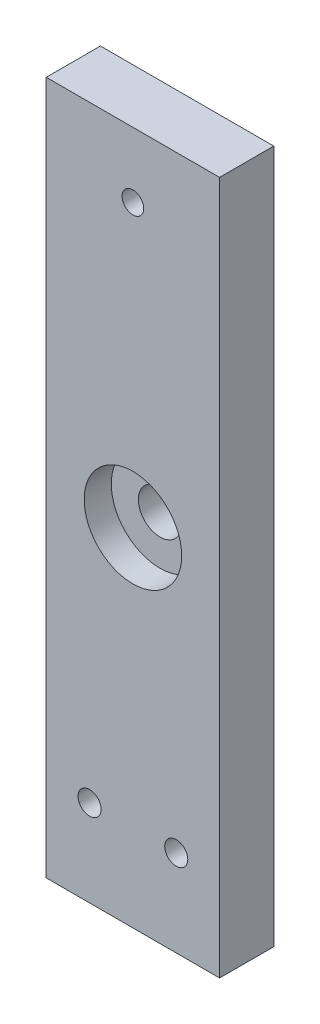
ISO-10303-21;
HEADER;
FILE_DESCRIPTION(('STEP AP214'),'2;1');
FILE_NAME('part.step','',(''),(''),'','','');
FILE_SCHEMA(('AUTOMOTIVE_DESIGN { 1 0 10303 214 1 1 1 1 }'));
ENDSEC;
DATA;
#1=APPLICATION_CONTEXT('core data for automotive mechanical design processes');
#2=APPLICATION_PROTOCOL_DEFINITION('international standard','automotive_design',2000,#1);
#3=PRODUCT_CONTEXT('',#1,'mechanical');
#4=PRODUCT('Part','Part','',(#3));
#5=PRODUCT_RELATED_PRODUCT_CATEGORY('part','',(#4));
#6=PRODUCT_DEFINITION_FORMATION('','',#4);
#7=PRODUCT_DEFINITION_CONTEXT('part definition',#1,'design');
#8=PRODUCT_DEFINITION('design','',#6,#7);
#9=PRODUCT_DEFINITION_SHAPE('','',#8);
#10=(LENGTH_UNIT() NAMED_UNIT(*) SI_UNIT(.MILLI.,.METRE.));
#11=(NAMED_UNIT(*) PLANE_ANGLE_UNIT() SI_UNIT($,.RADIAN.));
#12=(NAMED_UNIT(*) SI_UNIT($,.STERADIAN.) SOLID_ANGLE_UNIT());
#13=UNCERTAINTY_MEASURE_WITH_UNIT(LENGTH_MEASURE(1.E-05),#10,'distance_accuracy_value','');
#14=(GEOMETRIC_REPRESENTATION_CONTEXT(3) GLOBAL_UNCERTAINTY_ASSIGNED_CONTEXT((#13)) GLOBAL_UNIT_ASSIGNED_CONTEXT((#10,
#11,#12)) REPRESENTATION_CONTEXT('',''));
#15=CARTESIAN_POINT('',(0.,0.,0.));
#16=DIRECTION('',(0.,0.,1.));
#17=DIRECTION('',(1.,0.,0.));
#18=AXIS2_PLACEMENT_3D('',#15,#16,#17);
#19=CARTESIAN_POINT('',(0.,76.2,15.875));
#20=DIRECTION('',(0.,0.,-1.));
#21=DIRECTION('',(-1.,0.,0.));
#22=AXIS2_PLACEMENT_3D('',#19,#20,#21);
#23=CYLINDRICAL_SURFACE('',#22,6.35);
#24=CARTESIAN_POINT('',(0.,76.2,0.));
#25=DIRECTION('',(0.,0.,-1.));
#26=DIRECTION('',(-1.,0.,0.));
#27=AXIS2_PLACEMENT_3D('',#24,#25,#26);
#28=CIRCLE('',#27,6.35);
#29=CARTESIAN_POINT('',(-6.35,76.2,0.));
#30=VERTEX_POINT('',#29);
#31=EDGE_CURVE('E247',#30,#30,#28,.T.);
#32=ORIENTED_EDGE('',*,*,#31,.T.);
#33=EDGE_LOOP('',(#32));
#34=FACE_BOUND('',#33,.T.);
#35=CARTESIAN_POINT('',(0.,76.2,7.9375));
#36=DIRECTION('',(0.,0.,1.));
#37=DIRECTION('',(1.,0.,0.));
#38=AXIS2_PLACEMENT_3D('',#35,#36,#37);
#39=CIRCLE('',#38,6.35);
#40=CARTESIAN_POINT('',(6.35,76.2,7.9375));
#41=VERTEX_POINT('',#40);
#42=EDGE_CURVE('E243',#41,#41,#39,.T.);
#43=ORIENTED_EDGE('',*,*,#42,.T.);
#44=EDGE_LOOP('',(#43));
#45=FACE_BOUND('',#44,.T.);
#46=ADVANCED_FACE('F33',(#34,#45),#23,.F.);
#47=CARTESIAN_POINT('',(-25.4,-25.4,15.875));
#48=DIRECTION('',(-1.,0.,0.));
#49=DIRECTION('',(0.,0.,1.));
#50=AXIS2_PLACEMENT_3D('',#47,#48,#49);
#51=PLANE('',#50);
#52=DIRECTION('',(0.,1.,0.));
#53=VECTOR('',#52,1.);
#54=CARTESIAN_POINT('',(-25.4,-25.4,0.));
#55=LINE('',#54,#53);
#56=CARTESIAN_POINT('',(-25.4,-25.4,0.));
#57=VERTEX_POINT('',#56);
#58=CARTESIAN_POINT('',(-25.4,177.8,0.));
#59=VERTEX_POINT('',#58);
#60=EDGE_CURVE('E100',#57,#59,#55,.T.);
#61=ORIENTED_EDGE('',*,*,#60,.F.);
#62=DIRECTION('',(0.,0.,-1.));
#63=VECTOR('',#62,1.);
#64=CARTESIAN_POINT('',(-25.4,-25.4,15.875));
#65=LINE('',#64,#63);
#66=CARTESIAN_POINT('',(-25.4,-25.4,15.875));
#67=VERTEX_POINT('',#66);
#68=EDGE_CURVE('E11',#67,#57,#65,.T.);
#69=ORIENTED_EDGE('',*,*,#68,.F.);
#70=DIRECTION('',(0.,1.,0.));
#71=VECTOR('',#70,1.);
#72=CARTESIAN_POINT('',(-25.4,-25.4,15.875));
#73=LINE('',#72,#71);
#74=CARTESIAN_POINT('',(-25.4,177.8,15.875));
#75=VERTEX_POINT('',#74);
#76=EDGE_CURVE('E94',#67,#75,#73,.T.);
#77=ORIENTED_EDGE('',*,*,#76,.T.);
#78=DIRECTION('',(0.,0.,-1.));
#79=VECTOR('',#78,1.);
#80=CARTESIAN_POINT('',(-25.4,177.8,15.875));
#81=LINE('',#80,#79);
#82=EDGE_CURVE('E37',#75,#59,#81,.T.);
#83=ORIENTED_EDGE('',*,*,#82,.T.);
#84=EDGE_LOOP('',(#61,#69,#77,#83));
#85=FACE_BOUND('',#84,.T.);
#86=ADVANCED_FACE('F35',(#85),#51,.T.);
#87=CARTESIAN_POINT('',(-25.4,-25.4,15.875));
#88=DIRECTION('',(0.,1.,0.));
#89=DIRECTION('',(0.,0.,1.));
#90=AXIS2_PLACEMENT_3D('',#87,#88,#89);
#91=PLANE('',#90);
#92=DIRECTION('',(1.,0.,0.));
#93=VECTOR('',#92,1.);
#94=CARTESIAN_POINT('',(-25.4,-25.4,0.));
#95=LINE('',#94,#93);
#96=CARTESIAN_POINT('',(25.4,-25.4,0.));
#97=VERTEX_POINT('',#96);
#98=EDGE_CURVE('E67',#57,#97,#95,.T.);
#99=ORIENTED_EDGE('',*,*,#98,.T.);
#100=DIRECTION('',(0.,0.,-1.));
#101=VECTOR('',#100,1.);
#102=CARTESIAN_POINT('',(25.4,-25.4,15.875));
#103=LINE('',#102,#101);
#104=CARTESIAN_POINT('',(25.4,-25.4,15.875));
#105=VERTEX_POINT('',#104);
#106=EDGE_CURVE('E43',#105,#97,#103,.T.);
#107=ORIENTED_EDGE('',*,*,#106,.F.);
#108=DIRECTION('',(1.,0.,0.));
#109=VECTOR('',#108,1.);
#110=CARTESIAN_POINT('',(-25.4,-25.4,15.875));
#111=LINE('',#110,#109);
#112=EDGE_CURVE('E84',#67,#105,#111,.T.);
#113=ORIENTED_EDGE('',*,*,#112,.F.);
#114=ORIENTED_EDGE('',*,*,#68,.T.);
#115=EDGE_LOOP('',(#99,#107,#113,#114));
#116=FACE_BOUND('',#115,.T.);
#117=ADVANCED_FACE('F111',(#116),#91,.F.);
#118=CARTESIAN_POINT('',(25.4,-25.4,15.875));
#119=DIRECTION('',(-1.,0.,0.));
#120=DIRECTION('',(0.,0.,1.));
#121=AXIS2_PLACEMENT_3D('',#118,#119,#120);
#122=PLANE('',#121);
#123=DIRECTION('',(0.,1.,0.));
#124=VECTOR('',#123,1.);
#125=CARTESIAN_POINT('',(25.4,-25.4,0.));
#126=LINE('',#125,#124);
#127=CARTESIAN_POINT('',(25.4,177.8,0.));
#128=VERTEX_POINT('',#127);
#129=EDGE_CURVE('E91',#97,#128,#126,.T.);
#130=ORIENTED_EDGE('',*,*,#129,.T.);
#131=DIRECTION('',(0.,0.,-1.));
#132=VECTOR('',#131,1.);
#133=CARTESIAN_POINT('',(25.4,177.8,15.875));
#134=LINE('',#133,#132);
#135=CARTESIAN_POINT('',(25.4,177.8,15.875));
#136=VERTEX_POINT('',#135);
#137=EDGE_CURVE('E88',#136,#128,#134,.T.);
#138=ORIENTED_EDGE('',*,*,#137,.F.);
#139=DIRECTION('',(0.,1.,0.));
#140=VECTOR('',#139,1.);
#141=CARTESIAN_POINT('',(25.4,-25.4,15.875));
#142=LINE('',#141,#140);
#143=EDGE_CURVE('E79',#105,#136,#142,.T.);
#144=ORIENTED_EDGE('',*,*,#143,.F.);
#145=ORIENTED_EDGE('',*,*,#106,.T.);
#146=EDGE_LOOP('',(#130,#138,#144,#145));
#147=FACE_BOUND('',#146,.T.);
#148=ADVANCED_FACE('F89',(#147),#122,.F.);
#149=CARTESIAN_POINT('',(-25.4,177.8,15.875));
#150=DIRECTION('',(0.,1.,0.));
#151=DIRECTION('',(0.,0.,1.));
#152=AXIS2_PLACEMENT_3D('',#149,#150,#151);
#153=PLANE('',#152);
#154=DIRECTION('',(1.,0.,0.));
#155=VECTOR('',#154,1.);
#156=CARTESIAN_POINT('',(-25.4,177.8,0.));
#157=LINE('',#156,#155);
#158=EDGE_CURVE('E103',#59,#128,#157,.T.);
#159=ORIENTED_EDGE('',*,*,#158,.F.);
#160=ORIENTED_EDGE('',*,*,#82,.F.);
#161=DIRECTION('',(1.,0.,0.));
#162=VECTOR('',#161,1.);
#163=CARTESIAN_POINT('',(-25.4,177.8,15.875));
#164=LINE('',#163,#162);
#165=EDGE_CURVE('E83',#75,#136,#164,.T.);
#166=ORIENTED_EDGE('',*,*,#165,.T.);
#167=ORIENTED_EDGE('',*,*,#137,.T.);
#168=EDGE_LOOP('',(#159,#160,#166,#167));
#169=FACE_BOUND('',#168,.T.);
#170=ADVANCED_FACE('F93',(#169),#153,.T.);
#171=CARTESIAN_POINT('',(0.,0.,15.875));
#172=DIRECTION('',(0.,0.,-1.));
#173=DIRECTION('',(-1.,0.,0.));
#174=AXIS2_PLACEMENT_3D('',#171,#172,#173);
#175=PLANE('',#174);
#176=CARTESIAN_POINT('',(0.,76.2,15.875));
#177=DIRECTION('',(0.,0.,1.));
#178=DIRECTION('',(1.,0.,0.));
#179=AXIS2_PLACEMENT_3D('',#176,#177,#178);
#180=CIRCLE('',#179,14.2875);
#181=CARTESIAN_POINT('',(14.2875,76.2,15.875));
#182=VERTEX_POINT('',#181);
#183=EDGE_CURVE('E248',#182,#182,#180,.T.);
#184=ORIENTED_EDGE('',*,*,#183,.F.);
#185=EDGE_LOOP('',(#184));
#186=FACE_BOUND('',#185,.T.);
#187=CARTESIAN_POINT('',(0.,158.75,15.875));
#188=DIRECTION('',(0.,0.,-1.));
#189=DIRECTION('',(-1.,0.,0.));
#190=AXIS2_PLACEMENT_3D('',#187,#188,#189);
#191=CIRCLE('',#190,3.175);
#192=CARTESIAN_POINT('',(-3.175,158.75,15.875));
#193=VERTEX_POINT('',#192);
#194=EDGE_CURVE('E258',#193,#193,#191,.T.);
#195=ORIENTED_EDGE('',*,*,#194,.T.);
#196=EDGE_LOOP('',(#195));
#197=FACE_BOUND('',#196,.T.);
#198=CARTESIAN_POINT('',(-12.7,0.,15.875));
#199=DIRECTION('',(0.,0.,1.));
#200=DIRECTION('',(1.,0.,0.));
#201=AXIS2_PLACEMENT_3D('',#198,#199,#200);
#202=CIRCLE('',#201,3.37819999999999);
#203=CARTESIAN_POINT('',(-9.32180000000001,0.,15.875));
#204=VERTEX_POINT('',#203);
#205=EDGE_CURVE('E270',#204,#204,#202,.T.);
#206=ORIENTED_EDGE('',*,*,#205,.F.);
#207=EDGE_LOOP('',(#206));
#208=FACE_BOUND('',#207,.T.);
#209=CARTESIAN_POINT('',(12.7,0.,15.875));
#210=DIRECTION('',(0.,0.,1.));
#211=DIRECTION('',(1.,0.,0.));
#212=AXIS2_PLACEMENT_3D('',#209,#210,#211);
#213=CIRCLE('',#212,3.37819999999999);
#214=CARTESIAN_POINT('',(16.0782,0.,15.875));
#215=VERTEX_POINT('',#214);
#216=EDGE_CURVE('E265',#215,#215,#213,.T.);
#217=ORIENTED_EDGE('',*,*,#216,.F.);
#218=EDGE_LOOP('',(#217));
#219=FACE_BOUND('',#218,.T.);
#220=ORIENTED_EDGE('',*,*,#76,.F.);
#221=ORIENTED_EDGE('',*,*,#112,.T.);
#222=ORIENTED_EDGE('',*,*,#143,.T.);
#223=ORIENTED_EDGE('',*,*,#165,.F.);
#224=EDGE_LOOP('',(#220,#221,#222,#223));
#225=FACE_BOUND('',#224,.T.);
#226=ADVANCED_FACE('F82',(#186,#197,#208,#219,#225),#175,.F.);
#227=CARTESIAN_POINT('',(0.,0.,0.));
#228=DIRECTION('',(0.,0.,-1.));
#229=DIRECTION('',(-1.,0.,0.));
#230=AXIS2_PLACEMENT_3D('',#227,#228,#229);
#231=PLANE('',#230);
#232=ORIENTED_EDGE('',*,*,#31,.F.);
#233=EDGE_LOOP('',(#232));
#234=FACE_BOUND('',#233,.T.);
#235=CARTESIAN_POINT('',(0.,158.75,0.));
#236=DIRECTION('',(0.,0.,-1.));
#237=DIRECTION('',(-1.,0.,0.));
#238=AXIS2_PLACEMENT_3D('',#235,#236,#237);
#239=CIRCLE('',#238,6.34999999999999);
#240=CARTESIAN_POINT('',(-6.34999999999999,158.75,0.));
#241=VERTEX_POINT('',#240);
#242=EDGE_CURVE('E261',#241,#241,#239,.T.);
#243=ORIENTED_EDGE('',*,*,#242,.F.);
#244=EDGE_LOOP('',(#243));
#245=FACE_BOUND('',#244,.T.);
#246=CARTESIAN_POINT('',(-12.7,0.,0.));
#247=DIRECTION('',(0.,0.,1.));
#248=DIRECTION('',(1.,0.,0.));
#249=AXIS2_PLACEMENT_3D('',#246,#247,#248);
#250=CIRCLE('',#249,3.37819999999999);
#251=CARTESIAN_POINT('',(-9.32180000000001,0.,0.));
#252=VERTEX_POINT('',#251);
#253=EDGE_CURVE('E104',#252,#252,#250,.T.);
#254=ORIENTED_EDGE('',*,*,#253,.T.);
#255=EDGE_LOOP('',(#254));
#256=FACE_BOUND('',#255,.T.);
#257=CARTESIAN_POINT('',(12.7,0.,0.));
#258=DIRECTION('',(0.,0.,1.));
#259=DIRECTION('',(1.,0.,0.));
#260=AXIS2_PLACEMENT_3D('',#257,#258,#259);
#261=CIRCLE('',#260,3.37819999999999);
#262=CARTESIAN_POINT('',(16.0782,0.,0.));
#263=VERTEX_POINT('',#262);
#264=EDGE_CURVE('E273',#263,#263,#261,.T.);
#265=ORIENTED_EDGE('',*,*,#264,.T.);
#266=EDGE_LOOP('',(#265));
#267=FACE_BOUND('',#266,.T.);
#268=ORIENTED_EDGE('',*,*,#60,.T.);
#269=ORIENTED_EDGE('',*,*,#158,.T.);
#270=ORIENTED_EDGE('',*,*,#129,.F.);
#271=ORIENTED_EDGE('',*,*,#98,.F.);
#272=EDGE_LOOP('',(#268,#269,#270,#271));
#273=FACE_BOUND('',#272,.T.);
#274=ADVANCED_FACE('F109',(#234,#245,#256,#267,#273),#231,.T.);
#275=CARTESIAN_POINT('',(12.7,0.,0.));
#276=DIRECTION('',(0.,0.,1.));
#277=DIRECTION('',(1.,0.,0.));
#278=AXIS2_PLACEMENT_3D('',#275,#276,#277);
#279=CYLINDRICAL_SURFACE('',#278,3.37819999999999);
#280=ORIENTED_EDGE('',*,*,#264,.F.);
#281=EDGE_LOOP('',(#280));
#282=FACE_BOUND('',#281,.T.);
#283=ORIENTED_EDGE('',*,*,#216,.T.);
#284=EDGE_LOOP('',(#283));
#285=FACE_BOUND('',#284,.T.);
#286=ADVANCED_FACE('F142',(#282,#285),#279,.F.);
#287=CARTESIAN_POINT('',(-12.7,0.,0.));
#288=DIRECTION('',(0.,0.,1.));
#289=DIRECTION('',(1.,0.,0.));
#290=AXIS2_PLACEMENT_3D('',#287,#288,#289);
#291=CYLINDRICAL_SURFACE('',#290,3.37819999999999);
#292=ORIENTED_EDGE('',*,*,#253,.F.);
#293=EDGE_LOOP('',(#292));
#294=FACE_BOUND('',#293,.T.);
#295=ORIENTED_EDGE('',*,*,#205,.T.);
#296=EDGE_LOOP('',(#295));
#297=FACE_BOUND('',#296,.T.);
#298=ADVANCED_FACE('F138',(#294,#297),#291,.F.);
#299=CARTESIAN_POINT('',(0.,158.75,6.35));
#300=DIRECTION('',(0.,0.,-1.));
#301=DIRECTION('',(-1.,0.,0.));
#302=AXIS2_PLACEMENT_3D('',#299,#300,#301);
#303=CYLINDRICAL_SURFACE('',#302,6.34999999999999);
#304=CARTESIAN_POINT('',(0.,158.75,6.35));
#305=DIRECTION('',(0.,0.,-1.));
#306=DIRECTION('',(-1.,0.,0.));
#307=AXIS2_PLACEMENT_3D('',#304,#305,#306);
#308=CIRCLE('',#307,6.34999999999999);
#309=CARTESIAN_POINT('',(-6.34999999999999,158.75,6.35));
#310=VERTEX_POINT('',#309);
#311=EDGE_CURVE('E262',#310,#310,#308,.T.);
#312=ORIENTED_EDGE('',*,*,#311,.F.);
#313=EDGE_LOOP('',(#312));
#314=FACE_BOUND('',#313,.T.);
#315=ORIENTED_EDGE('',*,*,#242,.T.);
#316=EDGE_LOOP('',(#315));
#317=FACE_BOUND('',#316,.T.);
#318=ADVANCED_FACE('F134',(#314,#317),#303,.F.);
#319=CARTESIAN_POINT('',(0.,158.75,6.35));
#320=DIRECTION('',(0.,0.,-1.));
#321=DIRECTION('',(-1.,0.,0.));
#322=AXIS2_PLACEMENT_3D('',#319,#320,#321);
#323=PLANE('',#322);
#324=CARTESIAN_POINT('',(0.,158.75,6.35));
#325=DIRECTION('',(0.,0.,-1.));
#326=DIRECTION('',(-1.,0.,0.));
#327=AXIS2_PLACEMENT_3D('',#324,#325,#326);
#328=CIRCLE('',#327,3.175);
#329=CARTESIAN_POINT('',(-3.175,158.75,6.35));
#330=VERTEX_POINT('',#329);
#331=EDGE_CURVE('E250',#330,#330,#328,.T.);
#332=ORIENTED_EDGE('',*,*,#331,.F.);
#333=EDGE_LOOP('',(#332));
#334=FACE_BOUND('',#333,.T.);
#335=ORIENTED_EDGE('',*,*,#311,.T.);
#336=EDGE_LOOP('',(#335));
#337=FACE_BOUND('',#336,.T.);
#338=ADVANCED_FACE('F130',(#334,#337),#323,.T.);
#339=CARTESIAN_POINT('',(0.,158.75,6.35));
#340=DIRECTION('',(0.,0.,-1.));
#341=DIRECTION('',(-1.,0.,0.));
#342=AXIS2_PLACEMENT_3D('',#339,#340,#341);
#343=CYLINDRICAL_SURFACE('',#342,3.175);
#344=ORIENTED_EDGE('',*,*,#194,.F.);
#345=EDGE_LOOP('',(#344));
#346=FACE_BOUND('',#345,.T.);
#347=ORIENTED_EDGE('',*,*,#331,.T.);
#348=EDGE_LOOP('',(#347));
#349=FACE_BOUND('',#348,.T.);
#350=ADVANCED_FACE('F127',(#346,#349),#343,.F.);
#351=CARTESIAN_POINT('',(0.,76.2,7.9375));
#352=DIRECTION('',(0.,0.,1.));
#353=DIRECTION('',(1.,0.,0.));
#354=AXIS2_PLACEMENT_3D('',#351,#352,#353);
#355=CYLINDRICAL_SURFACE('',#354,14.2875);
#356=CARTESIAN_POINT('',(0.,76.2,7.9375));
#357=DIRECTION('',(0.,0.,1.));
#358=DIRECTION('',(1.,0.,0.));
#359=AXIS2_PLACEMENT_3D('',#356,#357,#358);
#360=CIRCLE('',#359,14.2875);
#361=CARTESIAN_POINT('',(14.2875,76.2,7.9375));
#362=VERTEX_POINT('',#361);
#363=EDGE_CURVE('E246',#362,#362,#360,.T.);
#364=ORIENTED_EDGE('',*,*,#363,.F.);
#365=EDGE_LOOP('',(#364));
#366=FACE_BOUND('',#365,.T.);
#367=ORIENTED_EDGE('',*,*,#183,.T.);
#368=EDGE_LOOP('',(#367));
#369=FACE_BOUND('',#368,.T.);
#370=ADVANCED_FACE('F125',(#366,#369),#355,.F.);
#371=CARTESIAN_POINT('',(0.,76.2,7.9375));
#372=DIRECTION('',(0.,0.,1.));
#373=DIRECTION('',(1.,0.,0.));
#374=AXIS2_PLACEMENT_3D('',#371,#372,#373);
#375=PLANE('',#374);
#376=ORIENTED_EDGE('',*,*,#42,.F.);
#377=EDGE_LOOP('',(#376));
#378=FACE_BOUND('',#377,.T.);
#379=ORIENTED_EDGE('',*,*,#363,.T.);
#380=EDGE_LOOP('',(#379));
#381=FACE_BOUND('',#380,.T.);
#382=ADVANCED_FACE('F193',(#378,#381),#375,.T.);
#383=CLOSED_SHELL('',(#46,#86,#117,#148,#170,#226,#274,#286,#298,#318,#338,#350,#370,#382));
#384=MANIFOLD_SOLID_BREP('B2',#383);
#385=ADVANCED_BREP_SHAPE_REPRESENTATION('',(#18,#384),#14);
#386=SHAPE_DEFINITION_REPRESENTATION(#9,#385);
ENDSEC;
END-ISO-10303-21;
